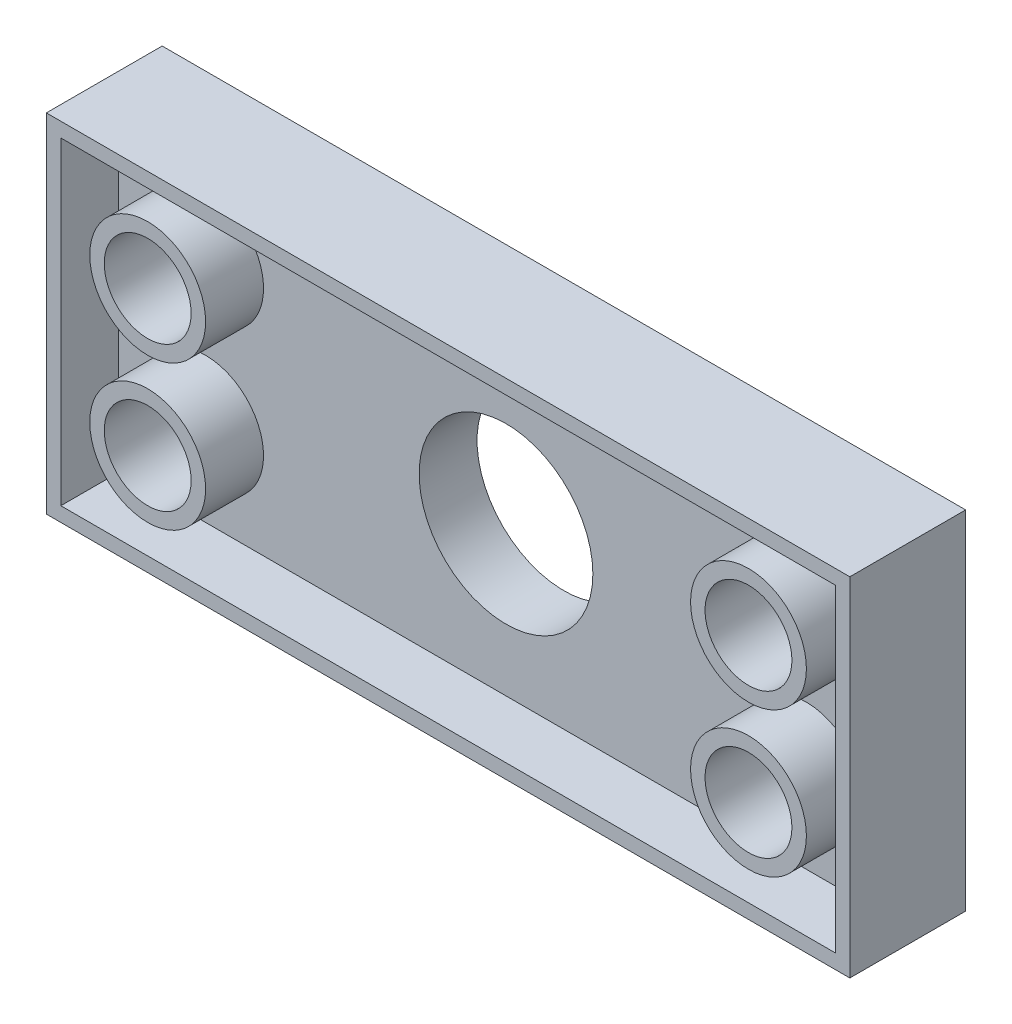
ISO-10303-21;
HEADER;
FILE_DESCRIPTION(('STEP AP214'),'2;1');
FILE_NAME('part.step','',(''),(''),'','','');
FILE_SCHEMA(('AUTOMOTIVE_DESIGN { 1 0 10303 214 1 1 1 1 }'));
ENDSEC;
DATA;
#1=APPLICATION_CONTEXT('core data for automotive mechanical design processes');
#2=APPLICATION_PROTOCOL_DEFINITION('international standard','automotive_design',2000,#1);
#3=PRODUCT_CONTEXT('',#1,'mechanical');
#4=PRODUCT('Part','Part','',(#3));
#5=PRODUCT_RELATED_PRODUCT_CATEGORY('part','',(#4));
#6=PRODUCT_DEFINITION_FORMATION('','',#4);
#7=PRODUCT_DEFINITION_CONTEXT('part definition',#1,'design');
#8=PRODUCT_DEFINITION('design','',#6,#7);
#9=PRODUCT_DEFINITION_SHAPE('','',#8);
#10=(LENGTH_UNIT() NAMED_UNIT(*) SI_UNIT(.MILLI.,.METRE.));
#11=(NAMED_UNIT(*) PLANE_ANGLE_UNIT() SI_UNIT($,.RADIAN.));
#12=(NAMED_UNIT(*) SI_UNIT($,.STERADIAN.) SOLID_ANGLE_UNIT());
#13=UNCERTAINTY_MEASURE_WITH_UNIT(LENGTH_MEASURE(1.E-05),#10,'distance_accuracy_value','');
#14=(GEOMETRIC_REPRESENTATION_CONTEXT(3) GLOBAL_UNCERTAINTY_ASSIGNED_CONTEXT((#13)) GLOBAL_UNIT_ASSIGNED_CONTEXT((#10,
#11,#12)) REPRESENTATION_CONTEXT('',''));
#15=CARTESIAN_POINT('',(0.,0.,0.));
#16=DIRECTION('',(0.,0.,1.));
#17=DIRECTION('',(1.,0.,0.));
#18=AXIS2_PLACEMENT_3D('',#15,#16,#17);
#19=CARTESIAN_POINT('',(0.,0.,12.7));
#20=DIRECTION('',(0.,0.,-1.));
#21=DIRECTION('',(-1.,0.,0.));
#22=AXIS2_PLACEMENT_3D('',#19,#20,#21);
#23=PLANE('',#22);
#24=CARTESIAN_POINT('',(-19.8422892159268,113.750650191126,12.7));
#25=DIRECTION('',(0.,0.,-1.));
#26=DIRECTION('',(-1.,0.,0.));
#27=AXIS2_PLACEMENT_3D('',#24,#25,#26);
#28=CIRCLE('',#27,12.7);
#29=CARTESIAN_POINT('',(-32.5422892159268,113.750650191126,12.7));
#30=VERTEX_POINT('',#29);
#31=EDGE_CURVE('E52',#30,#30,#28,.F.);
#32=ORIENTED_EDGE('',*,*,#31,.F.);
#33=EDGE_LOOP('',(#32));
#34=FACE_BOUND('',#33,.T.);
#35=CARTESIAN_POINT('',(111.907710784073,145.500650191126,12.7));
#36=DIRECTION('',(0.,0.,-1.));
#37=DIRECTION('',(-1.,0.,0.));
#38=AXIS2_PLACEMENT_3D('',#35,#36,#37);
#39=CIRCLE('',#38,12.7);
#40=CARTESIAN_POINT('',(99.2077107840732,145.500650191126,12.7));
#41=VERTEX_POINT('',#40);
#42=EDGE_CURVE('E259',#41,#41,#39,.F.);
#43=ORIENTED_EDGE('',*,*,#42,.F.);
#44=EDGE_LOOP('',(#43));
#45=FACE_BOUND('',#44,.T.);
#46=DIRECTION('',(0.,1.,0.));
#47=VECTOR('',#46,1.);
#48=CARTESIAN_POINT('',(130.957710784073,164.550650191126,12.7));
#49=LINE('',#48,#47);
#50=CARTESIAN_POINT('',(130.957710784073,94.7006501911258,12.7));
#51=VERTEX_POINT('',#50);
#52=CARTESIAN_POINT('',(130.957710784073,164.550650191126,12.7));
#53=VERTEX_POINT('',#52);
#54=EDGE_CURVE('E248',#51,#53,#49,.T.);
#55=ORIENTED_EDGE('',*,*,#54,.T.);
#56=DIRECTION('',(-1.,0.,0.));
#57=VECTOR('',#56,1.);
#58=CARTESIAN_POINT('',(130.957710784073,164.550650191126,12.7));
#59=LINE('',#58,#57);
#60=CARTESIAN_POINT('',(-38.8922892159268,164.550650191126,12.7));
#61=VERTEX_POINT('',#60);
#62=EDGE_CURVE('E115',#53,#61,#59,.T.);
#63=ORIENTED_EDGE('',*,*,#62,.T.);
#64=DIRECTION('',(0.,-1.,0.));
#65=VECTOR('',#64,1.);
#66=CARTESIAN_POINT('',(-38.8922892159268,164.550650191126,12.7));
#67=LINE('',#66,#65);
#68=CARTESIAN_POINT('',(-38.8922892159268,94.7006501911258,12.7));
#69=VERTEX_POINT('',#68);
#70=EDGE_CURVE('E253',#61,#69,#67,.T.);
#71=ORIENTED_EDGE('',*,*,#70,.T.);
#72=DIRECTION('',(1.,0.,0.));
#73=VECTOR('',#72,1.);
#74=CARTESIAN_POINT('',(130.957710784073,94.7006501911258,12.7));
#75=LINE('',#74,#73);
#76=EDGE_CURVE('E67',#69,#51,#75,.T.);
#77=ORIENTED_EDGE('',*,*,#76,.T.);
#78=EDGE_LOOP('',(#55,#63,#71,#77));
#79=FACE_BOUND('',#78,.T.);
#80=CARTESIAN_POINT('',(46.0327107840732,127.370341000818,12.7));
#81=DIRECTION('',(0.,0.,1.));
#82=DIRECTION('',(1.,0.,0.));
#83=AXIS2_PLACEMENT_3D('',#80,#81,#82);
#84=CIRCLE('',#83,19.05);
#85=CARTESIAN_POINT('',(65.0827107840732,127.370341000818,12.7));
#86=VERTEX_POINT('',#85);
#87=EDGE_CURVE('E225',#86,#86,#84,.T.);
#88=ORIENTED_EDGE('',*,*,#87,.F.);
#89=EDGE_LOOP('',(#88));
#90=FACE_BOUND('',#89,.T.);
#91=CARTESIAN_POINT('',(111.907710784073,113.750650191126,12.7));
#92=DIRECTION('',(0.,0.,-1.));
#93=DIRECTION('',(-1.,0.,0.));
#94=AXIS2_PLACEMENT_3D('',#91,#92,#93);
#95=CIRCLE('',#94,12.7);
#96=CARTESIAN_POINT('',(99.2077107840732,113.750650191126,12.7));
#97=VERTEX_POINT('',#96);
#98=EDGE_CURVE('E263',#97,#97,#95,.F.);
#99=ORIENTED_EDGE('',*,*,#98,.F.);
#100=EDGE_LOOP('',(#99));
#101=FACE_BOUND('',#100,.T.);
#102=CARTESIAN_POINT('',(-19.8422892159268,145.500650191126,12.7));
#103=DIRECTION('',(0.,0.,-1.));
#104=DIRECTION('',(-1.,0.,0.));
#105=AXIS2_PLACEMENT_3D('',#102,#103,#104);
#106=CIRCLE('',#105,12.7);
#107=CARTESIAN_POINT('',(-32.5422892159268,145.500650191126,12.7));
#108=VERTEX_POINT('',#107);
#109=EDGE_CURVE('E11',#108,#108,#106,.F.);
#110=ORIENTED_EDGE('',*,*,#109,.F.);
#111=EDGE_LOOP('',(#110));
#112=FACE_BOUND('',#111,.T.);
#113=ADVANCED_FACE('F43',(#34,#45,#79,#90,#101,#112),#23,.F.);
#114=CARTESIAN_POINT('',(0.,0.,0.));
#115=DIRECTION('',(0.,0.,-1.));
#116=DIRECTION('',(-1.,0.,0.));
#117=AXIS2_PLACEMENT_3D('',#114,#115,#116);
#118=PLANE('',#117);
#119=CARTESIAN_POINT('',(111.907710784073,113.750650191126,0.));
#120=DIRECTION('',(0.,0.,1.));
#121=DIRECTION('',(1.,0.,0.));
#122=AXIS2_PLACEMENT_3D('',#119,#120,#121);
#123=CIRCLE('',#122,9.52500000000001);
#124=CARTESIAN_POINT('',(121.432710784073,113.750650191126,0.));
#125=VERTEX_POINT('',#124);
#126=EDGE_CURVE('E229',#125,#125,#123,.T.);
#127=ORIENTED_EDGE('',*,*,#126,.T.);
#128=EDGE_LOOP('',(#127));
#129=FACE_BOUND('',#128,.T.);
#130=CARTESIAN_POINT('',(-19.8422892159268,113.750650191126,0.));
#131=DIRECTION('',(0.,0.,1.));
#132=DIRECTION('',(1.,0.,0.));
#133=AXIS2_PLACEMENT_3D('',#130,#131,#132);
#134=CIRCLE('',#133,9.525);
#135=CARTESIAN_POINT('',(-10.3172892159268,113.750650191126,0.));
#136=VERTEX_POINT('',#135);
#137=EDGE_CURVE('E240',#136,#136,#134,.T.);
#138=ORIENTED_EDGE('',*,*,#137,.T.);
#139=EDGE_LOOP('',(#138));
#140=FACE_BOUND('',#139,.T.);
#141=CARTESIAN_POINT('',(-19.8422892159268,145.500650191126,0.));
#142=DIRECTION('',(0.,0.,1.));
#143=DIRECTION('',(1.,0.,0.));
#144=AXIS2_PLACEMENT_3D('',#141,#142,#143);
#145=CIRCLE('',#144,9.525);
#146=CARTESIAN_POINT('',(-10.3172892159268,145.500650191126,0.));
#147=VERTEX_POINT('',#146);
#148=EDGE_CURVE('E244',#147,#147,#145,.T.);
#149=ORIENTED_EDGE('',*,*,#148,.T.);
#150=EDGE_LOOP('',(#149));
#151=FACE_BOUND('',#150,.T.);
#152=CARTESIAN_POINT('',(111.907710784073,145.500650191126,0.));
#153=DIRECTION('',(0.,0.,1.));
#154=DIRECTION('',(1.,0.,0.));
#155=AXIS2_PLACEMENT_3D('',#152,#153,#154);
#156=CIRCLE('',#155,9.525);
#157=CARTESIAN_POINT('',(121.432710784073,145.500650191126,0.));
#158=VERTEX_POINT('',#157);
#159=EDGE_CURVE('E236',#158,#158,#156,.T.);
#160=ORIENTED_EDGE('',*,*,#159,.T.);
#161=EDGE_LOOP('',(#160));
#162=FACE_BOUND('',#161,.T.);
#163=CARTESIAN_POINT('',(46.0327107840732,127.370341000818,0.));
#164=DIRECTION('',(0.,0.,1.));
#165=DIRECTION('',(1.,0.,0.));
#166=AXIS2_PLACEMENT_3D('',#163,#164,#165);
#167=CIRCLE('',#166,19.05);
#168=CARTESIAN_POINT('',(65.0827107840732,127.370341000818,0.));
#169=VERTEX_POINT('',#168);
#170=EDGE_CURVE('E224',#169,#169,#167,.T.);
#171=ORIENTED_EDGE('',*,*,#170,.T.);
#172=EDGE_LOOP('',(#171));
#173=FACE_BOUND('',#172,.T.);
#174=DIRECTION('',(1.,0.,0.));
#175=VECTOR('',#174,1.);
#176=CARTESIAN_POINT('',(134.132710784073,167.725650191126,0.));
#177=LINE('',#176,#175);
#178=CARTESIAN_POINT('',(-42.0672892159268,167.725650191126,0.));
#179=VERTEX_POINT('',#178);
#180=CARTESIAN_POINT('',(134.132710784073,167.725650191126,0.));
#181=VERTEX_POINT('',#180);
#182=EDGE_CURVE('E143',#179,#181,#177,.T.);
#183=ORIENTED_EDGE('',*,*,#182,.T.);
#184=DIRECTION('',(0.,-1.,0.));
#185=VECTOR('',#184,1.);
#186=CARTESIAN_POINT('',(134.132710784073,91.5256501911258,0.));
#187=LINE('',#186,#185);
#188=CARTESIAN_POINT('',(134.132710784073,91.5256501911258,0.));
#189=VERTEX_POINT('',#188);
#190=EDGE_CURVE('E170',#181,#189,#187,.T.);
#191=ORIENTED_EDGE('',*,*,#190,.T.);
#192=DIRECTION('',(-1.,0.,0.));
#193=VECTOR('',#192,1.);
#194=CARTESIAN_POINT('',(-42.0672892159268,91.5256501911258,0.));
#195=LINE('',#194,#193);
#196=CARTESIAN_POINT('',(-42.0672892159268,91.5256501911258,0.));
#197=VERTEX_POINT('',#196);
#198=EDGE_CURVE('E174',#189,#197,#195,.T.);
#199=ORIENTED_EDGE('',*,*,#198,.T.);
#200=DIRECTION('',(0.,1.,0.));
#201=VECTOR('',#200,1.);
#202=CARTESIAN_POINT('',(-42.0672892159268,167.725650191126,0.));
#203=LINE('',#202,#201);
#204=EDGE_CURVE('E154',#197,#179,#203,.T.);
#205=ORIENTED_EDGE('',*,*,#204,.T.);
#206=EDGE_LOOP('',(#183,#191,#199,#205));
#207=FACE_BOUND('',#206,.T.);
#208=ADVANCED_FACE('F45',(#129,#140,#151,#162,#173,#207),#118,.T.);
#209=CARTESIAN_POINT('',(-19.8422892159268,145.500650191126,12.7));
#210=DIRECTION('',(0.,0.,-1.));
#211=DIRECTION('',(-1.,0.,0.));
#212=AXIS2_PLACEMENT_3D('',#209,#210,#211);
#213=CYLINDRICAL_SURFACE('',#212,9.525);
#214=ORIENTED_EDGE('',*,*,#148,.F.);
#215=EDGE_LOOP('',(#214));
#216=FACE_BOUND('',#215,.T.);
#217=CARTESIAN_POINT('',(-19.8422892159268,145.500650191126,25.4));
#218=DIRECTION('',(0.,0.,1.));
#219=DIRECTION('',(1.,0.,0.));
#220=AXIS2_PLACEMENT_3D('',#217,#218,#219);
#221=CIRCLE('',#220,9.52499999999999);
#222=CARTESIAN_POINT('',(-10.3172892159268,145.500650191126,25.4));
#223=VERTEX_POINT('',#222);
#224=EDGE_CURVE('E196',#223,#223,#221,.T.);
#225=ORIENTED_EDGE('',*,*,#224,.T.);
#226=EDGE_LOOP('',(#225));
#227=FACE_BOUND('',#226,.T.);
#228=ADVANCED_FACE('F339',(#216,#227),#213,.F.);
#229=CARTESIAN_POINT('',(-19.8422892159268,113.750650191126,12.7));
#230=DIRECTION('',(0.,0.,-1.));
#231=DIRECTION('',(-1.,0.,0.));
#232=AXIS2_PLACEMENT_3D('',#229,#230,#231);
#233=CYLINDRICAL_SURFACE('',#232,9.525);
#234=ORIENTED_EDGE('',*,*,#137,.F.);
#235=EDGE_LOOP('',(#234));
#236=FACE_BOUND('',#235,.T.);
#237=CARTESIAN_POINT('',(-19.8422892159268,113.750650191126,25.4));
#238=DIRECTION('',(0.,0.,1.));
#239=DIRECTION('',(1.,0.,0.));
#240=AXIS2_PLACEMENT_3D('',#237,#238,#239);
#241=CIRCLE('',#240,9.52500000000001);
#242=CARTESIAN_POINT('',(-10.3172892159268,113.750650191126,25.4));
#243=VERTEX_POINT('',#242);
#244=EDGE_CURVE('E204',#243,#243,#241,.T.);
#245=ORIENTED_EDGE('',*,*,#244,.T.);
#246=EDGE_LOOP('',(#245));
#247=FACE_BOUND('',#246,.T.);
#248=ADVANCED_FACE('F335',(#236,#247),#233,.F.);
#249=CARTESIAN_POINT('',(111.907710784073,145.500650191126,12.7));
#250=DIRECTION('',(0.,0.,-1.));
#251=DIRECTION('',(-1.,0.,0.));
#252=AXIS2_PLACEMENT_3D('',#249,#250,#251);
#253=CYLINDRICAL_SURFACE('',#252,9.525);
#254=ORIENTED_EDGE('',*,*,#159,.F.);
#255=EDGE_LOOP('',(#254));
#256=FACE_BOUND('',#255,.T.);
#257=CARTESIAN_POINT('',(111.907710784073,145.500650191126,25.4));
#258=DIRECTION('',(0.,0.,1.));
#259=DIRECTION('',(1.,0.,0.));
#260=AXIS2_PLACEMENT_3D('',#257,#258,#259);
#261=CIRCLE('',#260,9.525);
#262=CARTESIAN_POINT('',(121.432710784073,145.500650191126,25.4));
#263=VERTEX_POINT('',#262);
#264=EDGE_CURVE('E216',#263,#263,#261,.T.);
#265=ORIENTED_EDGE('',*,*,#264,.T.);
#266=EDGE_LOOP('',(#265));
#267=FACE_BOUND('',#266,.T.);
#268=ADVANCED_FACE('F331',(#256,#267),#253,.F.);
#269=CARTESIAN_POINT('',(111.907710784073,113.750650191126,12.7));
#270=DIRECTION('',(0.,0.,-1.));
#271=DIRECTION('',(-1.,0.,0.));
#272=AXIS2_PLACEMENT_3D('',#269,#270,#271);
#273=CYLINDRICAL_SURFACE('',#272,9.52500000000001);
#274=ORIENTED_EDGE('',*,*,#126,.F.);
#275=EDGE_LOOP('',(#274));
#276=FACE_BOUND('',#275,.T.);
#277=CARTESIAN_POINT('',(111.907710784073,113.750650191126,25.4));
#278=DIRECTION('',(0.,0.,1.));
#279=DIRECTION('',(1.,0.,0.));
#280=AXIS2_PLACEMENT_3D('',#277,#278,#279);
#281=CIRCLE('',#280,9.52500000000001);
#282=CARTESIAN_POINT('',(121.432710784073,113.750650191126,25.4));
#283=VERTEX_POINT('',#282);
#284=EDGE_CURVE('E212',#283,#283,#281,.T.);
#285=ORIENTED_EDGE('',*,*,#284,.T.);
#286=EDGE_LOOP('',(#285));
#287=FACE_BOUND('',#286,.T.);
#288=ADVANCED_FACE('F327',(#276,#287),#273,.F.);
#289=CARTESIAN_POINT('',(46.0327107840732,127.370341000818,12.7));
#290=DIRECTION('',(0.,0.,-1.));
#291=DIRECTION('',(-1.,0.,0.));
#292=AXIS2_PLACEMENT_3D('',#289,#290,#291);
#293=CYLINDRICAL_SURFACE('',#292,19.05);
#294=ORIENTED_EDGE('',*,*,#87,.T.);
#295=EDGE_LOOP('',(#294));
#296=FACE_BOUND('',#295,.T.);
#297=ORIENTED_EDGE('',*,*,#170,.F.);
#298=EDGE_LOOP('',(#297));
#299=FACE_BOUND('',#298,.T.);
#300=ADVANCED_FACE('F320',(#296,#299),#293,.F.);
#301=CARTESIAN_POINT('',(111.907710784073,145.500650191126,25.4));
#302=DIRECTION('',(0.,0.,1.));
#303=DIRECTION('',(1.,0.,0.));
#304=AXIS2_PLACEMENT_3D('',#301,#302,#303);
#305=PLANE('',#304);
#306=CARTESIAN_POINT('',(111.907710784073,145.500650191126,25.4));
#307=DIRECTION('',(0.,0.,1.));
#308=DIRECTION('',(1.,0.,0.));
#309=AXIS2_PLACEMENT_3D('',#306,#307,#308);
#310=CIRCLE('',#309,12.7);
#311=CARTESIAN_POINT('',(124.607710784073,145.500650191126,25.4));
#312=VERTEX_POINT('',#311);
#313=EDGE_CURVE('E220',#312,#312,#310,.T.);
#314=ORIENTED_EDGE('',*,*,#313,.T.);
#315=EDGE_LOOP('',(#314));
#316=FACE_BOUND('',#315,.T.);
#317=ORIENTED_EDGE('',*,*,#264,.F.);
#318=EDGE_LOOP('',(#317));
#319=FACE_BOUND('',#318,.T.);
#320=ADVANCED_FACE('F317',(#316,#319),#305,.T.);
#321=CARTESIAN_POINT('',(111.907710784073,145.500650191126,25.4));
#322=DIRECTION('',(0.,0.,-1.));
#323=DIRECTION('',(-1.,0.,0.));
#324=AXIS2_PLACEMENT_3D('',#321,#322,#323);
#325=CYLINDRICAL_SURFACE('',#324,12.7);
#326=ORIENTED_EDGE('',*,*,#313,.F.);
#327=EDGE_LOOP('',(#326));
#328=FACE_BOUND('',#327,.T.);
#329=ORIENTED_EDGE('',*,*,#42,.T.);
#330=EDGE_LOOP('',(#329));
#331=FACE_BOUND('',#330,.T.);
#332=ADVANCED_FACE('F315',(#328,#331),#325,.T.);
#333=CARTESIAN_POINT('',(111.907710784073,113.750650191126,25.4));
#334=DIRECTION('',(0.,0.,1.));
#335=DIRECTION('',(1.,0.,0.));
#336=AXIS2_PLACEMENT_3D('',#333,#334,#335);
#337=PLANE('',#336);
#338=CARTESIAN_POINT('',(111.907710784073,113.750650191126,25.4));
#339=DIRECTION('',(0.,0.,1.));
#340=DIRECTION('',(1.,0.,0.));
#341=AXIS2_PLACEMENT_3D('',#338,#339,#340);
#342=CIRCLE('',#341,12.7);
#343=CARTESIAN_POINT('',(124.607710784073,113.750650191126,25.4));
#344=VERTEX_POINT('',#343);
#345=EDGE_CURVE('E208',#344,#344,#342,.T.);
#346=ORIENTED_EDGE('',*,*,#345,.T.);
#347=EDGE_LOOP('',(#346));
#348=FACE_BOUND('',#347,.T.);
#349=ORIENTED_EDGE('',*,*,#284,.F.);
#350=EDGE_LOOP('',(#349));
#351=FACE_BOUND('',#350,.T.);
#352=ADVANCED_FACE('F311',(#348,#351),#337,.T.);
#353=CARTESIAN_POINT('',(111.907710784073,113.750650191126,25.4));
#354=DIRECTION('',(0.,0.,-1.));
#355=DIRECTION('',(-1.,0.,0.));
#356=AXIS2_PLACEMENT_3D('',#353,#354,#355);
#357=CYLINDRICAL_SURFACE('',#356,12.7);
#358=ORIENTED_EDGE('',*,*,#345,.F.);
#359=EDGE_LOOP('',(#358));
#360=FACE_BOUND('',#359,.T.);
#361=ORIENTED_EDGE('',*,*,#98,.T.);
#362=EDGE_LOOP('',(#361));
#363=FACE_BOUND('',#362,.T.);
#364=ADVANCED_FACE('F307',(#360,#363),#357,.T.);
#365=CARTESIAN_POINT('',(-19.8422892159268,113.750650191126,25.4));
#366=DIRECTION('',(0.,0.,1.));
#367=DIRECTION('',(1.,0.,0.));
#368=AXIS2_PLACEMENT_3D('',#365,#366,#367);
#369=PLANE('',#368);
#370=CARTESIAN_POINT('',(-19.8422892159268,113.750650191126,25.4));
#371=DIRECTION('',(0.,0.,1.));
#372=DIRECTION('',(1.,0.,0.));
#373=AXIS2_PLACEMENT_3D('',#370,#371,#372);
#374=CIRCLE('',#373,12.7);
#375=CARTESIAN_POINT('',(-7.14228921592682,113.750650191126,25.4));
#376=VERTEX_POINT('',#375);
#377=EDGE_CURVE('E200',#376,#376,#374,.T.);
#378=ORIENTED_EDGE('',*,*,#377,.T.);
#379=EDGE_LOOP('',(#378));
#380=FACE_BOUND('',#379,.T.);
#381=ORIENTED_EDGE('',*,*,#244,.F.);
#382=EDGE_LOOP('',(#381));
#383=FACE_BOUND('',#382,.T.);
#384=ADVANCED_FACE('F303',(#380,#383),#369,.T.);
#385=CARTESIAN_POINT('',(-19.8422892159268,113.750650191126,25.4));
#386=DIRECTION('',(0.,0.,-1.));
#387=DIRECTION('',(-1.,0.,0.));
#388=AXIS2_PLACEMENT_3D('',#385,#386,#387);
#389=CYLINDRICAL_SURFACE('',#388,12.7);
#390=ORIENTED_EDGE('',*,*,#377,.F.);
#391=EDGE_LOOP('',(#390));
#392=FACE_BOUND('',#391,.T.);
#393=ORIENTED_EDGE('',*,*,#31,.T.);
#394=EDGE_LOOP('',(#393));
#395=FACE_BOUND('',#394,.T.);
#396=ADVANCED_FACE('F270',(#392,#395),#389,.T.);
#397=CARTESIAN_POINT('',(-19.8422892159268,145.500650191126,25.4));
#398=DIRECTION('',(0.,0.,1.));
#399=DIRECTION('',(1.,0.,0.));
#400=AXIS2_PLACEMENT_3D('',#397,#398,#399);
#401=PLANE('',#400);
#402=CARTESIAN_POINT('',(-19.8422892159268,145.500650191126,25.4));
#403=DIRECTION('',(0.,0.,1.));
#404=DIRECTION('',(1.,0.,0.));
#405=AXIS2_PLACEMENT_3D('',#402,#403,#404);
#406=CIRCLE('',#405,12.7);
#407=CARTESIAN_POINT('',(-7.14228921592682,145.500650191126,25.4));
#408=VERTEX_POINT('',#407);
#409=EDGE_CURVE('E184',#408,#408,#406,.T.);
#410=ORIENTED_EDGE('',*,*,#409,.T.);
#411=EDGE_LOOP('',(#410));
#412=FACE_BOUND('',#411,.T.);
#413=ORIENTED_EDGE('',*,*,#224,.F.);
#414=EDGE_LOOP('',(#413));
#415=FACE_BOUND('',#414,.T.);
#416=ADVANCED_FACE('F285',(#412,#415),#401,.T.);
#417=CARTESIAN_POINT('',(-19.8422892159268,145.500650191126,25.4));
#418=DIRECTION('',(0.,0.,-1.));
#419=DIRECTION('',(-1.,0.,0.));
#420=AXIS2_PLACEMENT_3D('',#417,#418,#419);
#421=CYLINDRICAL_SURFACE('',#420,12.7);
#422=ORIENTED_EDGE('',*,*,#409,.F.);
#423=EDGE_LOOP('',(#422));
#424=FACE_BOUND('',#423,.T.);
#425=ORIENTED_EDGE('',*,*,#109,.T.);
#426=EDGE_LOOP('',(#425));
#427=FACE_BOUND('',#426,.T.);
#428=ADVANCED_FACE('F283',(#424,#427),#421,.T.);
#429=CARTESIAN_POINT('',(130.957710784073,164.550650191126,25.4));
#430=DIRECTION('',(0.,1.,0.));
#431=DIRECTION('',(0.,0.,1.));
#432=AXIS2_PLACEMENT_3D('',#429,#430,#431);
#433=PLANE('',#432);
#434=DIRECTION('',(0.,0.,-1.));
#435=VECTOR('',#434,1.);
#436=CARTESIAN_POINT('',(-38.8922892159268,164.550650191126,25.4));
#437=LINE('',#436,#435);
#438=CARTESIAN_POINT('',(-38.8922892159268,164.550650191126,25.4));
#439=VERTEX_POINT('',#438);
#440=EDGE_CURVE('E140',#439,#61,#437,.T.);
#441=ORIENTED_EDGE('',*,*,#440,.T.);
#442=ORIENTED_EDGE('',*,*,#62,.F.);
#443=DIRECTION('',(0.,0.,-1.));
#444=VECTOR('',#443,1.);
#445=CARTESIAN_POINT('',(130.957710784073,164.550650191126,25.4));
#446=LINE('',#445,#444);
#447=CARTESIAN_POINT('',(130.957710784073,164.550650191126,25.4));
#448=VERTEX_POINT('',#447);
#449=EDGE_CURVE('E59',#448,#53,#446,.T.);
#450=ORIENTED_EDGE('',*,*,#449,.F.);
#451=DIRECTION('',(1.,0.,0.));
#452=VECTOR('',#451,1.);
#453=CARTESIAN_POINT('',(130.957710784073,164.550650191126,25.4));
#454=LINE('',#453,#452);
#455=EDGE_CURVE('E112',#439,#448,#454,.T.);
#456=ORIENTED_EDGE('',*,*,#455,.F.);
#457=EDGE_LOOP('',(#441,#442,#450,#456));
#458=FACE_BOUND('',#457,.T.);
#459=ADVANCED_FACE('F110',(#458),#433,.F.);
#460=CARTESIAN_POINT('',(-38.8922892159268,94.7006501911258,25.4));
#461=DIRECTION('',(0.,-1.,0.));
#462=DIRECTION('',(0.,0.,-1.));
#463=AXIS2_PLACEMENT_3D('',#460,#461,#462);
#464=PLANE('',#463);
#465=DIRECTION('',(0.,0.,-1.));
#466=VECTOR('',#465,1.);
#467=CARTESIAN_POINT('',(130.957710784073,94.7006501911258,25.4));
#468=LINE('',#467,#466);
#469=CARTESIAN_POINT('',(130.957710784073,94.7006501911258,25.4));
#470=VERTEX_POINT('',#469);
#471=EDGE_CURVE('E118',#470,#51,#468,.T.);
#472=ORIENTED_EDGE('',*,*,#471,.T.);
#473=ORIENTED_EDGE('',*,*,#76,.F.);
#474=DIRECTION('',(0.,0.,-1.));
#475=VECTOR('',#474,1.);
#476=CARTESIAN_POINT('',(-38.8922892159268,94.7006501911258,25.4));
#477=LINE('',#476,#475);
#478=CARTESIAN_POINT('',(-38.8922892159268,94.7006501911258,25.4));
#479=VERTEX_POINT('',#478);
#480=EDGE_CURVE('E144',#479,#69,#477,.T.);
#481=ORIENTED_EDGE('',*,*,#480,.F.);
#482=DIRECTION('',(-1.,0.,0.));
#483=VECTOR('',#482,1.);
#484=CARTESIAN_POINT('',(-38.8922892159268,94.7006501911258,25.4));
#485=LINE('',#484,#483);
#486=EDGE_CURVE('E128',#470,#479,#485,.T.);
#487=ORIENTED_EDGE('',*,*,#486,.F.);
#488=EDGE_LOOP('',(#472,#473,#481,#487));
#489=FACE_BOUND('',#488,.T.);
#490=ADVANCED_FACE('F292',(#489),#464,.F.);
#491=CARTESIAN_POINT('',(-38.8922892159268,164.550650191126,25.4));
#492=DIRECTION('',(-1.,0.,0.));
#493=DIRECTION('',(0.,-1.,0.));
#494=AXIS2_PLACEMENT_3D('',#491,#492,#493);
#495=PLANE('',#494);
#496=ORIENTED_EDGE('',*,*,#480,.T.);
#497=ORIENTED_EDGE('',*,*,#70,.F.);
#498=ORIENTED_EDGE('',*,*,#440,.F.);
#499=DIRECTION('',(0.,1.,0.));
#500=VECTOR('',#499,1.);
#501=CARTESIAN_POINT('',(-38.8922892159268,164.550650191126,25.4));
#502=LINE('',#501,#500);
#503=EDGE_CURVE('E119',#479,#439,#502,.T.);
#504=ORIENTED_EDGE('',*,*,#503,.F.);
#505=EDGE_LOOP('',(#496,#497,#498,#504));
#506=FACE_BOUND('',#505,.T.);
#507=ADVANCED_FACE('F423',(#506),#495,.F.);
#508=CARTESIAN_POINT('',(130.957710784073,94.7006501911258,25.4));
#509=DIRECTION('',(1.,0.,0.));
#510=DIRECTION('',(0.,0.,-1.));
#511=AXIS2_PLACEMENT_3D('',#508,#509,#510);
#512=PLANE('',#511);
#513=ORIENTED_EDGE('',*,*,#449,.T.);
#514=ORIENTED_EDGE('',*,*,#54,.F.);
#515=ORIENTED_EDGE('',*,*,#471,.F.);
#516=DIRECTION('',(0.,-1.,0.));
#517=VECTOR('',#516,1.);
#518=CARTESIAN_POINT('',(130.957710784073,94.7006501911258,25.4));
#519=LINE('',#518,#517);
#520=EDGE_CURVE('E123',#448,#470,#519,.T.);
#521=ORIENTED_EDGE('',*,*,#520,.F.);
#522=EDGE_LOOP('',(#513,#514,#515,#521));
#523=FACE_BOUND('',#522,.T.);
#524=ADVANCED_FACE('F124',(#523),#512,.F.);
#525=CARTESIAN_POINT('',(134.132710784073,167.725650191126,25.4));
#526=DIRECTION('',(0.,1.,0.));
#527=DIRECTION('',(0.,0.,1.));
#528=AXIS2_PLACEMENT_3D('',#525,#526,#527);
#529=PLANE('',#528);
#530=ORIENTED_EDGE('',*,*,#182,.F.);
#531=DIRECTION('',(0.,0.,-1.));
#532=VECTOR('',#531,1.);
#533=CARTESIAN_POINT('',(-42.0672892159268,167.725650191126,25.4));
#534=LINE('',#533,#532);
#535=CARTESIAN_POINT('',(-42.0672892159268,167.725650191126,25.4));
#536=VERTEX_POINT('',#535);
#537=EDGE_CURVE('E181',#536,#179,#534,.T.);
#538=ORIENTED_EDGE('',*,*,#537,.F.);
#539=DIRECTION('',(1.,0.,0.));
#540=VECTOR('',#539,1.);
#541=CARTESIAN_POINT('',(134.132710784073,167.725650191126,25.4));
#542=LINE('',#541,#540);
#543=CARTESIAN_POINT('',(134.132710784073,167.725650191126,25.4));
#544=VERTEX_POINT('',#543);
#545=EDGE_CURVE('E149',#536,#544,#542,.T.);
#546=ORIENTED_EDGE('',*,*,#545,.T.);
#547=DIRECTION('',(0.,0.,-1.));
#548=VECTOR('',#547,1.);
#549=CARTESIAN_POINT('',(134.132710784073,167.725650191126,25.4));
#550=LINE('',#549,#548);
#551=EDGE_CURVE('E166',#544,#181,#550,.T.);
#552=ORIENTED_EDGE('',*,*,#551,.T.);
#553=EDGE_LOOP('',(#530,#538,#546,#552));
#554=FACE_BOUND('',#553,.T.);
#555=ADVANCED_FACE('F298',(#554),#529,.T.);
#556=CARTESIAN_POINT('',(-42.0672892159268,167.725650191126,25.4));
#557=DIRECTION('',(-1.,0.,0.));
#558=DIRECTION('',(0.,0.,1.));
#559=AXIS2_PLACEMENT_3D('',#556,#557,#558);
#560=PLANE('',#559);
#561=ORIENTED_EDGE('',*,*,#204,.F.);
#562=DIRECTION('',(0.,0.,-1.));
#563=VECTOR('',#562,1.);
#564=CARTESIAN_POINT('',(-42.0672892159268,91.5256501911258,25.4));
#565=LINE('',#564,#563);
#566=CARTESIAN_POINT('',(-42.0672892159268,91.5256501911258,25.4));
#567=VERTEX_POINT('',#566);
#568=EDGE_CURVE('E185',#567,#197,#565,.T.);
#569=ORIENTED_EDGE('',*,*,#568,.F.);
#570=DIRECTION('',(0.,1.,0.));
#571=VECTOR('',#570,1.);
#572=CARTESIAN_POINT('',(-42.0672892159268,167.725650191126,25.4));
#573=LINE('',#572,#571);
#574=EDGE_CURVE('E162',#567,#536,#573,.T.);
#575=ORIENTED_EDGE('',*,*,#574,.T.);
#576=ORIENTED_EDGE('',*,*,#537,.T.);
#577=EDGE_LOOP('',(#561,#569,#575,#576));
#578=FACE_BOUND('',#577,.T.);
#579=ADVANCED_FACE('F370',(#578),#560,.T.);
#580=CARTESIAN_POINT('',(-42.0672892159268,91.5256501911258,25.4));
#581=DIRECTION('',(0.,-1.,0.));
#582=DIRECTION('',(0.,0.,-1.));
#583=AXIS2_PLACEMENT_3D('',#580,#581,#582);
#584=PLANE('',#583);
#585=ORIENTED_EDGE('',*,*,#198,.F.);
#586=DIRECTION('',(0.,0.,-1.));
#587=VECTOR('',#586,1.);
#588=CARTESIAN_POINT('',(134.132710784073,91.5256501911258,25.4));
#589=LINE('',#588,#587);
#590=CARTESIAN_POINT('',(134.132710784073,91.5256501911258,25.4));
#591=VERTEX_POINT('',#590);
#592=EDGE_CURVE('E188',#591,#189,#589,.T.);
#593=ORIENTED_EDGE('',*,*,#592,.F.);
#594=DIRECTION('',(-1.,0.,0.));
#595=VECTOR('',#594,1.);
#596=CARTESIAN_POINT('',(-42.0672892159268,91.5256501911258,25.4));
#597=LINE('',#596,#595);
#598=EDGE_CURVE('E158',#591,#567,#597,.T.);
#599=ORIENTED_EDGE('',*,*,#598,.T.);
#600=ORIENTED_EDGE('',*,*,#568,.T.);
#601=EDGE_LOOP('',(#585,#593,#599,#600));
#602=FACE_BOUND('',#601,.T.);
#603=ADVANCED_FACE('F368',(#602),#584,.T.);
#604=CARTESIAN_POINT('',(134.132710784073,91.5256501911258,25.4));
#605=DIRECTION('',(1.,0.,0.));
#606=DIRECTION('',(0.,0.,-1.));
#607=AXIS2_PLACEMENT_3D('',#604,#605,#606);
#608=PLANE('',#607);
#609=ORIENTED_EDGE('',*,*,#190,.F.);
#610=ORIENTED_EDGE('',*,*,#551,.F.);
#611=DIRECTION('',(0.,-1.,0.));
#612=VECTOR('',#611,1.);
#613=CARTESIAN_POINT('',(134.132710784073,91.5256501911258,25.4));
#614=LINE('',#613,#612);
#615=EDGE_CURVE('E153',#544,#591,#614,.T.);
#616=ORIENTED_EDGE('',*,*,#615,.T.);
#617=ORIENTED_EDGE('',*,*,#592,.T.);
#618=EDGE_LOOP('',(#609,#610,#616,#617));
#619=FACE_BOUND('',#618,.T.);
#620=ADVANCED_FACE('F364',(#619),#608,.T.);
#621=CARTESIAN_POINT('',(0.,0.,25.4));
#622=DIRECTION('',(0.,0.,1.));
#623=DIRECTION('',(1.,0.,0.));
#624=AXIS2_PLACEMENT_3D('',#621,#622,#623);
#625=PLANE('',#624);
#626=ORIENTED_EDGE('',*,*,#455,.T.);
#627=ORIENTED_EDGE('',*,*,#520,.T.);
#628=ORIENTED_EDGE('',*,*,#486,.T.);
#629=ORIENTED_EDGE('',*,*,#503,.T.);
#630=EDGE_LOOP('',(#626,#627,#628,#629));
#631=FACE_BOUND('',#630,.T.);
#632=ORIENTED_EDGE('',*,*,#545,.F.);
#633=ORIENTED_EDGE('',*,*,#574,.F.);
#634=ORIENTED_EDGE('',*,*,#598,.F.);
#635=ORIENTED_EDGE('',*,*,#615,.F.);
#636=EDGE_LOOP('',(#632,#633,#634,#635));
#637=FACE_BOUND('',#636,.T.);
#638=ADVANCED_FACE('F130',(#631,#637),#625,.T.);
#639=CLOSED_SHELL('',(#113,#208,#228,#248,#268,#288,#300,#320,#332,#352,#364,#384,#396,#416,
#428,#459,#490,#507,#524,#555,#579,#603,#620,#638));
#640=MANIFOLD_SOLID_BREP('B2',#639);
#641=ADVANCED_BREP_SHAPE_REPRESENTATION('',(#18,#640),#14);
#642=SHAPE_DEFINITION_REPRESENTATION(#9,#641);
ENDSEC;
END-ISO-10303-21;
